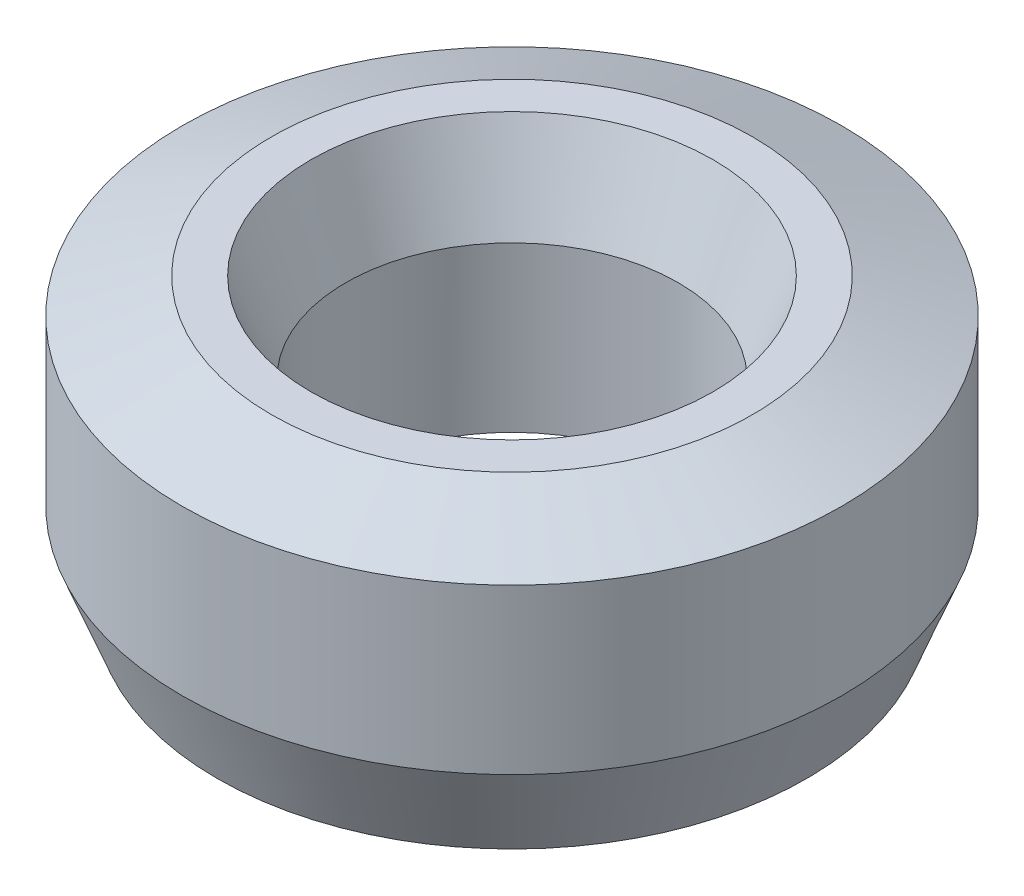
ISO-10303-21;
HEADER;
FILE_DESCRIPTION(('STEP AP214'),'2;1');
FILE_NAME('part.step','',(''),(''),'','','');
FILE_SCHEMA(('AUTOMOTIVE_DESIGN { 1 0 10303 214 1 1 1 1 }'));
ENDSEC;
DATA;
#1=APPLICATION_CONTEXT('core data for automotive mechanical design processes');
#2=APPLICATION_PROTOCOL_DEFINITION('international standard','automotive_design',2000,#1);
#3=PRODUCT_CONTEXT('',#1,'mechanical');
#4=PRODUCT('Part','Part','',(#3));
#5=PRODUCT_RELATED_PRODUCT_CATEGORY('part','',(#4));
#6=PRODUCT_DEFINITION_FORMATION('','',#4);
#7=PRODUCT_DEFINITION_CONTEXT('part definition',#1,'design');
#8=PRODUCT_DEFINITION('design','',#6,#7);
#9=PRODUCT_DEFINITION_SHAPE('','',#8);
#10=(LENGTH_UNIT() NAMED_UNIT(*) SI_UNIT(.MILLI.,.METRE.));
#11=(NAMED_UNIT(*) PLANE_ANGLE_UNIT() SI_UNIT($,.RADIAN.));
#12=(NAMED_UNIT(*) SI_UNIT($,.STERADIAN.) SOLID_ANGLE_UNIT());
#13=UNCERTAINTY_MEASURE_WITH_UNIT(LENGTH_MEASURE(1.E-05),#10,'distance_accuracy_value','');
#14=(GEOMETRIC_REPRESENTATION_CONTEXT(3) GLOBAL_UNCERTAINTY_ASSIGNED_CONTEXT((#13)) GLOBAL_UNIT_ASSIGNED_CONTEXT((#10,
#11,#12)) REPRESENTATION_CONTEXT('',''));
#15=CARTESIAN_POINT('',(0.,0.,0.));
#16=DIRECTION('',(0.,0.,1.));
#17=DIRECTION('',(1.,0.,0.));
#18=AXIS2_PLACEMENT_3D('',#15,#16,#17);
#19=CARTESIAN_POINT('',(0.,30.5751552980982,0.));
#20=DIRECTION('',(0.,-1.,0.));
#21=DIRECTION('',(0.,0.,-1.));
#22=AXIS2_PLACEMENT_3D('',#19,#20,#21);
#23=CYLINDRICAL_SURFACE('',#22,35.);
#24=CARTESIAN_POINT('',(0.,9.45496661537296,0.));
#25=DIRECTION('',(0.,1.,0.));
#26=DIRECTION('',(0.,0.,1.));
#27=AXIS2_PLACEMENT_3D('',#24,#25,#26);
#28=CIRCLE('',#27,35.);
#29=CARTESIAN_POINT('',(0.,9.45496661537296,-35.));
#30=VERTEX_POINT('',#29);
#31=EDGE_CURVE('E10',#30,#30,#28,.T.);
#32=CARTESIAN_POINT('',(0.,26.8739897406872,0.));
#33=DIRECTION('',(0.,1.,0.));
#34=DIRECTION('',(0.,0.,1.));
#35=AXIS2_PLACEMENT_3D('',#32,#33,#34);
#36=CIRCLE('',#35,35.);
#37=CARTESIAN_POINT('',(0.,26.8739897406872,-35.));
#38=VERTEX_POINT('',#37);
#39=EDGE_CURVE('E50',#38,#38,#36,.F.);
#40=CARTESIAN_POINT('',(0.,9.45496661537296,-35.));
#41=CARTESIAN_POINT('',(0.,9.63641477292831,-35.));
#42=CARTESIAN_POINT('',(0.,9.81786293048367,-35.));
#43=CARTESIAN_POINT('',(0.,10.1807592455944,-35.));
#44=CARTESIAN_POINT('',(0.,10.3622074031497,-35.));
#45=CARTESIAN_POINT('',(0.,10.7251037182605,-35.));
#46=CARTESIAN_POINT('',(0.,10.9065518758158,-35.));
#47=CARTESIAN_POINT('',(0.,11.2694481909265,-35.));
#48=CARTESIAN_POINT('',(0.,11.4508963484819,-35.));
#49=CARTESIAN_POINT('',(0.,11.8137926635926,-35.));
#50=CARTESIAN_POINT('',(0.,11.9952408211479,-35.));
#51=CARTESIAN_POINT('',(0.,12.3581371362587,-35.));
#52=CARTESIAN_POINT('',(0.,12.539585293814,-35.));
#53=CARTESIAN_POINT('',(0.,12.9024816089247,-35.));
#54=CARTESIAN_POINT('',(0.,13.0839297664801,-35.));
#55=CARTESIAN_POINT('',(0.,13.4468260815908,-35.));
#56=CARTESIAN_POINT('',(0.,13.6282742391462,-35.));
#57=CARTESIAN_POINT('',(0.,13.9911705542569,-35.));
#58=CARTESIAN_POINT('',(0.,14.1726187118122,-35.));
#59=CARTESIAN_POINT('',(0.,14.5355150269229,-35.));
#60=CARTESIAN_POINT('',(0.,14.7169631844783,-35.));
#61=CARTESIAN_POINT('',(0.,15.079859499589,-35.));
#62=CARTESIAN_POINT('',(0.,15.2613076571444,-35.));
#63=CARTESIAN_POINT('',(0.,15.6242039722551,-35.));
#64=CARTESIAN_POINT('',(0.,15.8056521298104,-35.));
#65=CARTESIAN_POINT('',(0.,16.1685484449211,-35.));
#66=CARTESIAN_POINT('',(0.,16.3499966024765,-35.));
#67=CARTESIAN_POINT('',(0.,16.7128929175872,-35.));
#68=CARTESIAN_POINT('',(0.,16.8943410751426,-35.));
#69=CARTESIAN_POINT('',(0.,17.2572373902533,-35.));
#70=CARTESIAN_POINT('',(0.,17.4386855478086,-35.));
#71=CARTESIAN_POINT('',(0.,17.8015818629194,-35.));
#72=CARTESIAN_POINT('',(0.,17.9830300204747,-35.));
#73=CARTESIAN_POINT('',(0.,18.3459263355854,-35.));
#74=CARTESIAN_POINT('',(0.,18.5273744931408,-35.));
#75=CARTESIAN_POINT('',(0.,18.8902708082515,-35.));
#76=CARTESIAN_POINT('',(0.,19.0717189658068,-35.));
#77=CARTESIAN_POINT('',(0.,19.4346152809176,-35.));
#78=CARTESIAN_POINT('',(0.,19.6160634384729,-35.));
#79=CARTESIAN_POINT('',(0.,19.9789597535836,-35.));
#80=CARTESIAN_POINT('',(0.,20.160407911139,-35.));
#81=CARTESIAN_POINT('',(0.,20.5233042262497,-35.));
#82=CARTESIAN_POINT('',(0.,20.7047523838051,-35.));
#83=CARTESIAN_POINT('',(0.,21.0676486989158,-35.));
#84=CARTESIAN_POINT('',(0.,21.2490968564711,-35.));
#85=CARTESIAN_POINT('',(0.,21.6119931715818,-35.));
#86=CARTESIAN_POINT('',(0.,21.7934413291372,-35.));
#87=CARTESIAN_POINT('',(0.,22.1563376442479,-35.));
#88=CARTESIAN_POINT('',(0.,22.3377858018033,-35.));
#89=CARTESIAN_POINT('',(0.,22.700682116914,-35.));
#90=CARTESIAN_POINT('',(0.,22.8821302744693,-35.));
#91=CARTESIAN_POINT('',(0.,23.24502658958,-35.));
#92=CARTESIAN_POINT('',(0.,23.4264747471354,-35.));
#93=CARTESIAN_POINT('',(0.,23.7893710622461,-35.));
#94=CARTESIAN_POINT('',(0.,23.9708192198015,-35.));
#95=CARTESIAN_POINT('',(0.,24.3337155349122,-35.));
#96=CARTESIAN_POINT('',(0.,24.5151636924675,-35.));
#97=CARTESIAN_POINT('',(0.,24.8780600075783,-35.));
#98=CARTESIAN_POINT('',(0.,25.0595081651336,-35.));
#99=CARTESIAN_POINT('',(0.,25.4224044802443,-35.));
#100=CARTESIAN_POINT('',(0.,25.6038526377997,-35.));
#101=CARTESIAN_POINT('',(0.,25.9667489529104,-35.));
#102=CARTESIAN_POINT('',(0.,26.1481971104657,-35.));
#103=CARTESIAN_POINT('',(0.,26.5110934255765,-35.));
#104=CARTESIAN_POINT('',(0.,26.6925415831318,-35.));
#105=CARTESIAN_POINT('',(0.,26.8739897406872,-35.));
#106=B_SPLINE_CURVE_WITH_KNOTS('',3,(#40,#41,#42,#43,#44,#45,#46,#47,#48,#49,#50,#51,#52,#53,
#54,#55,#56,#57,#58,#59,#60,#61,#62,#63,#64,#65,#66,#67,#68,#69,#70,#71,#72,#73,#74,#75,#76,#77,
#78,#79,#80,#81,#82,#83,#84,#85,#86,#87,#88,#89,#90,#91,#92,#93,#94,#95,#96,#97,#98,#99,#100,
#101,#102,#103,#104,#105),.UNSPECIFIED.,.F.,.F.,(4,2,2,2,2,2,2,2,2,2,2,2,2,2,2,2,2,2,2,2,2,2,2,
2,2,2,2,2,2,2,2,2,4),(0.,0.544344472666068,1.08868894533214,1.63303341799821,2.17737789066428,
2.72172236333035,3.26606683599642,3.81041130866249,4.35475578132856,4.89910025399463,
5.4434447266607,5.98778919932676,6.53213367199283,7.0764781446589,7.62082261732497,
8.16516708999104,8.70951156265711,9.25385603532318,9.79820050798925,10.3425449806553,
10.8868894533214,11.4312339259875,11.9755783986535,12.5199228713196,13.0642673439857,
13.6086118166517,14.1529562893178,14.6973007619839,15.2416452346499,15.785989707316,
16.3303341799821,16.8746786526482,17.4190231253142),.UNSPECIFIED.);
#107=EDGE_CURVE('BSEAM39',#30,#38,#106,.T.);
#108=ORIENTED_EDGE('',*,*,#31,.T.);
#109=ORIENTED_EDGE('',*,*,#39,.T.);
#110=ORIENTED_EDGE('',*,*,#107,.T.);
#111=ORIENTED_EDGE('',*,*,#107,.F.);
#112=EDGE_LOOP('',(#108,#110,#109,#111));
#113=FACE_BOUND('',#112,.T.);
#114=ADVANCED_FACE('F39',(#113),#23,.T.);
#115=CARTESIAN_POINT('',(0.,30.5751552980982,0.));
#116=DIRECTION('',(0.,1.,0.));
#117=DIRECTION('',(0.,0.,1.));
#118=AXIS2_PLACEMENT_3D('',#115,#116,#117);
#119=PLANE('',#118);
#120=CARTESIAN_POINT('',(0.,30.5751552980982,0.));
#121=DIRECTION('',(0.,1.,0.));
#122=DIRECTION('',(0.,0.,1.));
#123=AXIS2_PLACEMENT_3D('',#120,#121,#122);
#124=CIRCLE('',#123,21.3468964357302);
#125=CARTESIAN_POINT('',(0.,30.5751552980982,21.3468964357302));
#126=VERTEX_POINT('',#125);
#127=EDGE_CURVE('E58',#126,#126,#124,.F.);
#128=ORIENTED_EDGE('',*,*,#127,.T.);
#129=EDGE_LOOP('',(#128));
#130=FACE_BOUND('',#129,.T.);
#131=CARTESIAN_POINT('',(0.,30.5751552980982,0.));
#132=DIRECTION('',(0.,1.,0.));
#133=DIRECTION('',(0.,0.,1.));
#134=AXIS2_PLACEMENT_3D('',#131,#132,#133);
#135=CIRCLE('',#134,25.5450333846274);
#136=CARTESIAN_POINT('',(0.,30.5751552980982,25.5450333846274));
#137=VERTEX_POINT('',#136);
#138=EDGE_CURVE('E61',#137,#137,#135,.T.);
#139=ORIENTED_EDGE('',*,*,#138,.T.);
#140=EDGE_LOOP('',(#139));
#141=FACE_BOUND('',#140,.T.);
#142=ADVANCED_FACE('F88',(#130,#141),#119,.T.);
#143=CARTESIAN_POINT('',(0.,0.,0.));
#144=DIRECTION('',(0.,1.,0.));
#145=DIRECTION('',(0.,0.,1.));
#146=AXIS2_PLACEMENT_3D('',#143,#144,#145);
#147=PLANE('',#146);
#148=CARTESIAN_POINT('',(0.,0.,0.));
#149=DIRECTION('',(0.,1.,0.));
#150=DIRECTION('',(0.,0.,1.));
#151=AXIS2_PLACEMENT_3D('',#148,#149,#150);
#152=CIRCLE('',#151,27.1006974936918);
#153=CARTESIAN_POINT('',(0.,0.,27.1006974936918));
#154=VERTEX_POINT('',#153);
#155=EDGE_CURVE('E51',#154,#154,#152,.T.);
#156=ORIENTED_EDGE('',*,*,#155,.T.);
#157=EDGE_LOOP('',(#156));
#158=FACE_BOUND('',#157,.T.);
#159=CARTESIAN_POINT('',(0.,0.,0.));
#160=DIRECTION('',(0.,1.,0.));
#161=DIRECTION('',(0.,0.,1.));
#162=AXIS2_PLACEMENT_3D('',#159,#160,#161);
#163=CIRCLE('',#162,31.2988344425889);
#164=CARTESIAN_POINT('',(0.,0.,31.2988344425889));
#165=VERTEX_POINT('',#164);
#166=EDGE_CURVE('E54',#165,#165,#163,.F.);
#167=ORIENTED_EDGE('',*,*,#166,.T.);
#168=EDGE_LOOP('',(#167));
#169=FACE_BOUND('',#168,.T.);
#170=ADVANCED_FACE('F83',(#158,#169),#147,.F.);
#171=CARTESIAN_POINT('',(0.,30.5751552980982,0.));
#172=DIRECTION('',(0.,-1.,0.));
#173=DIRECTION('',(0.,0.,-1.));
#174=AXIS2_PLACEMENT_3D('',#171,#172,#173);
#175=CYLINDRICAL_SURFACE('',#174,17.6457308783192);
#176=CARTESIAN_POINT('',(0.,21.1201886827253,0.));
#177=DIRECTION('',(0.,1.,0.));
#178=DIRECTION('',(0.,0.,1.));
#179=AXIS2_PLACEMENT_3D('',#176,#177,#178);
#180=CIRCLE('',#179,17.6457308783192);
#181=CARTESIAN_POINT('',(0.,21.1201886827253,-17.6457308783192));
#182=VERTEX_POINT('',#181);
#183=EDGE_CURVE('E67',#182,#182,#180,.T.);
#184=CARTESIAN_POINT('',(0.,3.70116555741098,0.));
#185=DIRECTION('',(0.,1.,0.));
#186=DIRECTION('',(0.,0.,1.));
#187=AXIS2_PLACEMENT_3D('',#184,#185,#186);
#188=CIRCLE('',#187,17.6457308783192);
#189=CARTESIAN_POINT('',(0.,3.70116555741098,-17.6457308783192));
#190=VERTEX_POINT('',#189);
#191=EDGE_CURVE('E69',#190,#190,#188,.F.);
#192=CARTESIAN_POINT('',(0.,21.1201886827253,-17.6457308783192));
#193=CARTESIAN_POINT('',(0.,20.9387405251699,-17.6457308783192));
#194=CARTESIAN_POINT('',(0.,20.7572923676146,-17.6457308783192));
#195=CARTESIAN_POINT('',(0.,20.3943960525039,-17.6457308783192));
#196=CARTESIAN_POINT('',(0.,20.2129478949485,-17.6457308783192));
#197=CARTESIAN_POINT('',(0.,19.8500515798378,-17.6457308783192));
#198=CARTESIAN_POINT('',(0.,19.6686034222824,-17.6457308783192));
#199=CARTESIAN_POINT('',(0.,19.3057071071717,-17.6457308783192));
#200=CARTESIAN_POINT('',(0.,19.1242589496164,-17.6457308783192));
#201=CARTESIAN_POINT('',(0.,18.7613626345057,-17.6457308783192));
#202=CARTESIAN_POINT('',(0.,18.5799144769503,-17.6457308783192));
#203=CARTESIAN_POINT('',(0.,18.2170181618396,-17.6457308783192));
#204=CARTESIAN_POINT('',(0.,18.0355700042842,-17.6457308783192));
#205=CARTESIAN_POINT('',(0.,17.6726736891735,-17.6457308783192));
#206=CARTESIAN_POINT('',(0.,17.4912255316182,-17.6457308783192));
#207=CARTESIAN_POINT('',(0.,17.1283292165074,-17.6457308783192));
#208=CARTESIAN_POINT('',(0.,16.9468810589521,-17.6457308783192));
#209=CARTESIAN_POINT('',(0.,16.5839847438414,-17.6457308783192));
#210=CARTESIAN_POINT('',(0.,16.402536586286,-17.6457308783192));
#211=CARTESIAN_POINT('',(0.,16.0396402711753,-17.6457308783192));
#212=CARTESIAN_POINT('',(0.,15.8581921136199,-17.6457308783192));
#213=CARTESIAN_POINT('',(0.,15.4952957985092,-17.6457308783192));
#214=CARTESIAN_POINT('',(0.,15.3138476409539,-17.6457308783192));
#215=CARTESIAN_POINT('',(0.,14.9509513258432,-17.6457308783192));
#216=CARTESIAN_POINT('',(0.,14.7695031682878,-17.6457308783192));
#217=CARTESIAN_POINT('',(0.,14.4066068531771,-17.6457308783192));
#218=CARTESIAN_POINT('',(0.,14.2251586956217,-17.6457308783192));
#219=CARTESIAN_POINT('',(0.,13.862262380511,-17.6457308783192));
#220=CARTESIAN_POINT('',(0.,13.6808142229556,-17.6457308783192));
#221=CARTESIAN_POINT('',(0.,13.3179179078449,-17.6457308783192));
#222=CARTESIAN_POINT('',(0.,13.1364697502896,-17.6457308783192));
#223=CARTESIAN_POINT('',(0.,12.7735734351789,-17.6457308783192));
#224=CARTESIAN_POINT('',(0.,12.5921252776235,-17.6457308783192));
#225=CARTESIAN_POINT('',(0.,12.2292289625128,-17.6457308783192));
#226=CARTESIAN_POINT('',(0.,12.0477808049574,-17.6457308783192));
#227=CARTESIAN_POINT('',(0.,11.6848844898467,-17.6457308783192));
#228=CARTESIAN_POINT('',(0.,11.5034363322914,-17.6457308783192));
#229=CARTESIAN_POINT('',(0.,11.1405400171806,-17.6457308783192));
#230=CARTESIAN_POINT('',(0.,10.9590918596253,-17.6457308783192));
#231=CARTESIAN_POINT('',(0.,10.5961955445146,-17.6457308783192));
#232=CARTESIAN_POINT('',(0.,10.4147473869592,-17.6457308783192));
#233=CARTESIAN_POINT('',(0.,10.0518510718485,-17.6457308783192));
#234=CARTESIAN_POINT('',(0.,9.87040291429314,-17.6457308783192));
#235=CARTESIAN_POINT('',(0.,9.50750659918243,-17.6457308783192));
#236=CARTESIAN_POINT('',(0.,9.32605844162707,-17.6457308783192));
#237=CARTESIAN_POINT('',(0.,8.96316212651636,-17.6457308783192));
#238=CARTESIAN_POINT('',(0.,8.781713968961,-17.6457308783192));
#239=CARTESIAN_POINT('',(0.,8.41881765385028,-17.6457308783192));
#240=CARTESIAN_POINT('',(0.,8.23736949629492,-17.6457308783192));
#241=CARTESIAN_POINT('',(0.,7.87447318118421,-17.6457308783192));
#242=CARTESIAN_POINT('',(0.,7.69302502362885,-17.6457308783192));
#243=CARTESIAN_POINT('',(0.,7.33012870851814,-17.6457308783192));
#244=CARTESIAN_POINT('',(0.,7.14868055096278,-17.6457308783192));
#245=CARTESIAN_POINT('',(0.,6.78578423585206,-17.6457308783192));
#246=CARTESIAN_POINT('',(0.,6.60433607829671,-17.6457308783192));
#247=CARTESIAN_POINT('',(0.,6.24143976318599,-17.6457308783192));
#248=CARTESIAN_POINT('',(0.,6.05999160563063,-17.6457308783192));
#249=CARTESIAN_POINT('',(0.,5.69709529051992,-17.6457308783192));
#250=CARTESIAN_POINT('',(0.,5.51564713296456,-17.6457308783192));
#251=CARTESIAN_POINT('',(0.,5.15275081785385,-17.6457308783192));
#252=CARTESIAN_POINT('',(0.,4.97130266029849,-17.6457308783192));
#253=CARTESIAN_POINT('',(0.,4.60840634518777,-17.6457308783192));
#254=CARTESIAN_POINT('',(0.,4.42695818763241,-17.6457308783192));
#255=CARTESIAN_POINT('',(0.,4.0640618725217,-17.6457308783192));
#256=CARTESIAN_POINT('',(0.,3.88261371496634,-17.6457308783192));
#257=CARTESIAN_POINT('',(0.,3.70116555741098,-17.6457308783192));
#258=B_SPLINE_CURVE_WITH_KNOTS('',3,(#192,#193,#194,#195,#196,#197,#198,#199,#200,#201,#202,
#203,#204,#205,#206,#207,#208,#209,#210,#211,#212,#213,#214,#215,#216,#217,#218,#219,#220,#221,
#222,#223,#224,#225,#226,#227,#228,#229,#230,#231,#232,#233,#234,#235,#236,#237,#238,#239,#240,
#241,#242,#243,#244,#245,#246,#247,#248,#249,#250,#251,#252,#253,#254,#255,#256,#257),
.UNSPECIFIED.,.F.,.F.,(4,2,2,2,2,2,2,2,2,2,2,2,2,2,2,2,2,2,2,2,2,2,2,2,2,2,2,2,2,2,2,2,4),(0.,
0.544344472666072,1.08868894533214,1.63303341799822,2.17737789066429,2.72172236333036,
3.26606683599644,3.81041130866251,4.35475578132858,4.89910025399465,5.44344472666072,
5.9877891993268,6.53213367199287,7.07647814465894,7.62082261732501,8.16516708999109,
8.70951156265716,9.25385603532323,9.7982005079893,10.3425449806554,10.8868894533214,
11.4312339259875,11.9755783986536,12.5199228713197,13.0642673439857,13.6086118166518,
14.1529562893179,14.697300761984,15.24164523465,15.7859897073161,16.3303341799822,
16.8746786526482,17.4190231253143),.UNSPECIFIED.);
#259=EDGE_CURVE('BSEAM71',#182,#190,#258,.T.);
#260=ORIENTED_EDGE('',*,*,#183,.T.);
#261=ORIENTED_EDGE('',*,*,#191,.T.);
#262=ORIENTED_EDGE('',*,*,#259,.T.);
#263=ORIENTED_EDGE('',*,*,#259,.F.);
#264=EDGE_LOOP('',(#260,#262,#261,#263));
#265=FACE_BOUND('',#264,.T.);
#266=ADVANCED_FACE('F71',(#265),#175,.F.);
#267=CARTESIAN_POINT('',(0.,21.1201886827253,0.));
#268=DIRECTION('',(0.,1.,0.));
#269=DIRECTION('',(0.,0.,1.));
#270=AXIS2_PLACEMENT_3D('',#267,#268,#269);
#271=CONICAL_SURFACE('',#270,17.6457308783192,0.373115758157336);
#272=ORIENTED_EDGE('',*,*,#127,.F.);
#273=EDGE_LOOP('',(#272));
#274=FACE_BOUND('',#273,.T.);
#275=ORIENTED_EDGE('',*,*,#183,.F.);
#276=EDGE_LOOP('',(#275));
#277=FACE_BOUND('',#276,.T.);
#278=ADVANCED_FACE('F77',(#274,#277),#271,.F.);
#279=CARTESIAN_POINT('',(0.,0.,0.));
#280=DIRECTION('',(0.,-1.,0.));
#281=DIRECTION('',(0.,0.,-1.));
#282=AXIS2_PLACEMENT_3D('',#279,#280,#281);
#283=CONICAL_SURFACE('',#282,27.1006974936918,1.19768056863756);
#284=ORIENTED_EDGE('',*,*,#191,.F.);
#285=EDGE_LOOP('',(#284));
#286=FACE_BOUND('',#285,.T.);
#287=ORIENTED_EDGE('',*,*,#155,.F.);
#288=EDGE_LOOP('',(#287));
#289=FACE_BOUND('',#288,.T.);
#290=ADVANCED_FACE('F73',(#286,#289),#283,.F.);
#291=CARTESIAN_POINT('',(0.,9.45496661537296,0.));
#292=DIRECTION('',(0.,1.,0.));
#293=DIRECTION('',(0.,0.,1.));
#294=AXIS2_PLACEMENT_3D('',#291,#292,#293);
#295=CONICAL_SURFACE('',#294,35.,0.373115758157336);
#296=ORIENTED_EDGE('',*,*,#166,.F.);
#297=EDGE_LOOP('',(#296));
#298=FACE_BOUND('',#297,.T.);
#299=ORIENTED_EDGE('',*,*,#31,.F.);
#300=EDGE_LOOP('',(#299));
#301=FACE_BOUND('',#300,.T.);
#302=ADVANCED_FACE('F76',(#298,#301),#295,.T.);
#303=CARTESIAN_POINT('',(0.,30.5751552980982,0.));
#304=DIRECTION('',(0.,-1.,0.));
#305=DIRECTION('',(0.,0.,-1.));
#306=AXIS2_PLACEMENT_3D('',#303,#304,#305);
#307=CONICAL_SURFACE('',#306,25.5450333846274,1.19768056863756);
#308=ORIENTED_EDGE('',*,*,#39,.F.);
#309=EDGE_LOOP('',(#308));
#310=FACE_BOUND('',#309,.T.);
#311=ORIENTED_EDGE('',*,*,#138,.F.);
#312=EDGE_LOOP('',(#311));
#313=FACE_BOUND('',#312,.T.);
#314=ADVANCED_FACE('F45',(#310,#313),#307,.T.);
#315=CLOSED_SHELL('',(#114,#142,#170,#266,#278,#290,#302,#314));
#316=MANIFOLD_SOLID_BREP('B2',#315);
#317=ADVANCED_BREP_SHAPE_REPRESENTATION('',(#18,#316),#14);
#318=SHAPE_DEFINITION_REPRESENTATION(#9,#317);
ENDSEC;
END-ISO-10303-21;
